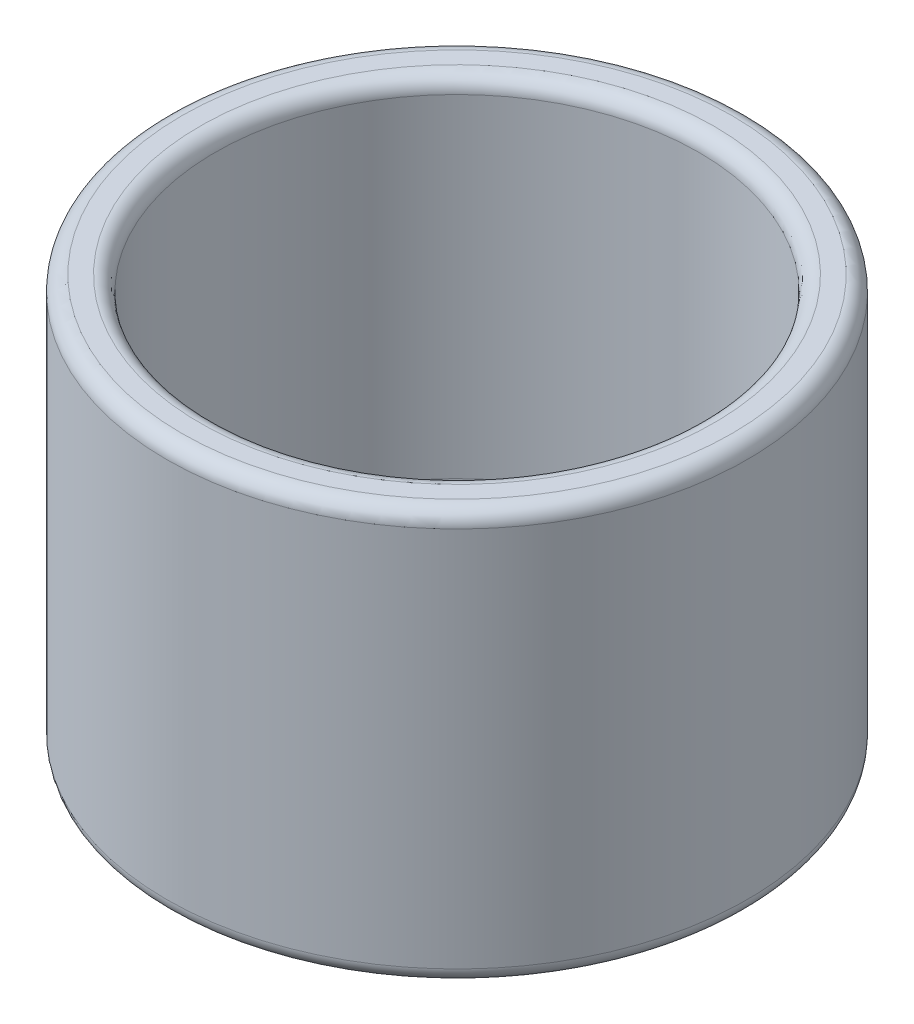
ISO-10303-21;
HEADER;
FILE_DESCRIPTION(('STEP AP214'),'2;1');
FILE_NAME('part.step','',(''),(''),'','','');
FILE_SCHEMA(('AUTOMOTIVE_DESIGN { 1 0 10303 214 1 1 1 1 }'));
ENDSEC;
DATA;
#1=APPLICATION_CONTEXT('core data for automotive mechanical design processes');
#2=APPLICATION_PROTOCOL_DEFINITION('international standard','automotive_design',2000,#1);
#3=PRODUCT_CONTEXT('',#1,'mechanical');
#4=PRODUCT('Part','Part','',(#3));
#5=PRODUCT_RELATED_PRODUCT_CATEGORY('part','',(#4));
#6=PRODUCT_DEFINITION_FORMATION('','',#4);
#7=PRODUCT_DEFINITION_CONTEXT('part definition',#1,'design');
#8=PRODUCT_DEFINITION('design','',#6,#7);
#9=PRODUCT_DEFINITION_SHAPE('','',#8);
#10=(LENGTH_UNIT() NAMED_UNIT(*) SI_UNIT(.MILLI.,.METRE.));
#11=(NAMED_UNIT(*) PLANE_ANGLE_UNIT() SI_UNIT($,.RADIAN.));
#12=(NAMED_UNIT(*) SI_UNIT($,.STERADIAN.) SOLID_ANGLE_UNIT());
#13=UNCERTAINTY_MEASURE_WITH_UNIT(LENGTH_MEASURE(1.E-05),#10,'distance_accuracy_value','');
#14=(GEOMETRIC_REPRESENTATION_CONTEXT(3) GLOBAL_UNCERTAINTY_ASSIGNED_CONTEXT((#13)) GLOBAL_UNIT_ASSIGNED_CONTEXT((#10,
#11,#12)) REPRESENTATION_CONTEXT('',''));
#15=CARTESIAN_POINT('',(0.,0.,0.));
#16=DIRECTION('',(0.,0.,1.));
#17=DIRECTION('',(1.,0.,0.));
#18=AXIS2_PLACEMENT_3D('',#15,#16,#17);
#19=CARTESIAN_POINT('',(-12.7,21.59,0.));
#20=DIRECTION('',(0.,-1.,0.));
#21=DIRECTION('',(0.,0.,-1.));
#22=AXIS2_PLACEMENT_3D('',#19,#20,#21);
#23=PLANE('',#22);
#24=CARTESIAN_POINT('',(0.,21.59,0.));
#25=DIRECTION('',(0.,-1.,0.));
#26=DIRECTION('',(0.,0.,-1.));
#27=AXIS2_PLACEMENT_3D('',#24,#25,#26);
#28=CIRCLE('',#27,13.49375);
#29=CARTESIAN_POINT('',(0.,21.59,-13.49375));
#30=VERTEX_POINT('',#29);
#31=EDGE_CURVE('E10',#30,#30,#28,.T.);
#32=ORIENTED_EDGE('',*,*,#31,.T.);
#33=EDGE_LOOP('',(#32));
#34=FACE_BOUND('',#33,.T.);
#35=CARTESIAN_POINT('',(0.,21.59,0.));
#36=DIRECTION('',(0.,-1.,0.));
#37=DIRECTION('',(0.,0.,-1.));
#38=AXIS2_PLACEMENT_3D('',#35,#36,#37);
#39=CIRCLE('',#38,14.44625);
#40=CARTESIAN_POINT('',(0.,21.59,-14.44625));
#41=VERTEX_POINT('',#40);
#42=EDGE_CURVE('E38',#41,#41,#39,.F.);
#43=ORIENTED_EDGE('',*,*,#42,.T.);
#44=EDGE_LOOP('',(#43));
#45=FACE_BOUND('',#44,.T.);
#46=ADVANCED_FACE('F31',(#34,#45),#23,.F.);
#47=CARTESIAN_POINT('',(0.,0.,0.));
#48=DIRECTION('',(0.,-1.,0.));
#49=DIRECTION('',(0.,0.,-1.));
#50=AXIS2_PLACEMENT_3D('',#47,#48,#49);
#51=CYLINDRICAL_SURFACE('',#50,15.24);
#52=CARTESIAN_POINT('',(0.,0.79375,0.));
#53=DIRECTION('',(0.,1.,0.));
#54=DIRECTION('',(0.,0.,1.));
#55=AXIS2_PLACEMENT_3D('',#52,#53,#54);
#56=CIRCLE('',#55,15.24);
#57=CARTESIAN_POINT('',(0.,0.79375,15.24));
#58=VERTEX_POINT('',#57);
#59=EDGE_CURVE('E54',#58,#58,#56,.T.);
#60=ORIENTED_EDGE('',*,*,#59,.T.);
#61=EDGE_LOOP('',(#60));
#62=FACE_BOUND('',#61,.T.);
#63=CARTESIAN_POINT('',(0.,20.79625,0.));
#64=DIRECTION('',(0.,-1.,0.));
#65=DIRECTION('',(0.,0.,-1.));
#66=AXIS2_PLACEMENT_3D('',#63,#64,#65);
#67=CIRCLE('',#66,15.24);
#68=CARTESIAN_POINT('',(0.,20.79625,-15.24));
#69=VERTEX_POINT('',#68);
#70=EDGE_CURVE('E57',#69,#69,#67,.T.);
#71=ORIENTED_EDGE('',*,*,#70,.T.);
#72=EDGE_LOOP('',(#71));
#73=FACE_BOUND('',#72,.T.);
#74=ADVANCED_FACE('F104',(#62,#73),#51,.T.);
#75=CARTESIAN_POINT('',(-15.24,0.,0.));
#76=DIRECTION('',(0.,1.,0.));
#77=DIRECTION('',(0.,0.,1.));
#78=AXIS2_PLACEMENT_3D('',#75,#76,#77);
#79=PLANE('',#78);
#80=CARTESIAN_POINT('',(0.,0.,0.));
#81=DIRECTION('',(0.,1.,0.));
#82=DIRECTION('',(0.,0.,1.));
#83=AXIS2_PLACEMENT_3D('',#80,#81,#82);
#84=CIRCLE('',#83,2.5527);
#85=CARTESIAN_POINT('',(0.,0.,2.5527));
#86=VERTEX_POINT('',#85);
#87=EDGE_CURVE('E63',#86,#86,#84,.T.);
#88=ORIENTED_EDGE('',*,*,#87,.T.);
#89=EDGE_LOOP('',(#88));
#90=FACE_BOUND('',#89,.T.);
#91=CARTESIAN_POINT('',(0.,0.,0.));
#92=DIRECTION('',(0.,1.,0.));
#93=DIRECTION('',(0.,0.,1.));
#94=AXIS2_PLACEMENT_3D('',#91,#92,#93);
#95=CIRCLE('',#94,14.44625);
#96=CARTESIAN_POINT('',(0.,0.,14.44625));
#97=VERTEX_POINT('',#96);
#98=EDGE_CURVE('E60',#97,#97,#95,.F.);
#99=ORIENTED_EDGE('',*,*,#98,.T.);
#100=EDGE_LOOP('',(#99));
#101=FACE_BOUND('',#100,.T.);
#102=ADVANCED_FACE('F79',(#90,#101),#79,.F.);
#103=CARTESIAN_POINT('',(0.,2.54,0.));
#104=DIRECTION('',(0.,-1.,0.));
#105=DIRECTION('',(0.,0.,-1.));
#106=AXIS2_PLACEMENT_3D('',#103,#104,#105);
#107=PLANE('',#106);
#108=CARTESIAN_POINT('',(0.,2.54,0.));
#109=DIRECTION('',(0.,1.,0.));
#110=DIRECTION('',(0.,0.,1.));
#111=AXIS2_PLACEMENT_3D('',#108,#109,#110);
#112=CIRCLE('',#111,4.8895);
#113=CARTESIAN_POINT('',(0.,2.54,4.8895));
#114=VERTEX_POINT('',#113);
#115=EDGE_CURVE('E69',#114,#114,#112,.T.);
#116=ORIENTED_EDGE('',*,*,#115,.F.);
#117=EDGE_LOOP('',(#116));
#118=FACE_BOUND('',#117,.T.);
#119=CARTESIAN_POINT('',(0.,2.54,0.));
#120=DIRECTION('',(0.,-1.,0.));
#121=DIRECTION('',(0.,0.,-1.));
#122=AXIS2_PLACEMENT_3D('',#119,#120,#121);
#123=CIRCLE('',#122,11.90625);
#124=CARTESIAN_POINT('',(0.,2.54,-11.90625));
#125=VERTEX_POINT('',#124);
#126=EDGE_CURVE('E42',#125,#125,#123,.F.);
#127=ORIENTED_EDGE('',*,*,#126,.T.);
#128=EDGE_LOOP('',(#127));
#129=FACE_BOUND('',#128,.T.);
#130=ADVANCED_FACE('F75',(#118,#129),#107,.F.);
#131=CARTESIAN_POINT('',(0.,0.,0.));
#132=DIRECTION('',(0.,-1.,0.));
#133=DIRECTION('',(0.,0.,-1.));
#134=AXIS2_PLACEMENT_3D('',#131,#132,#133);
#135=CYLINDRICAL_SURFACE('',#134,12.7);
#136=CARTESIAN_POINT('',(0.,3.33375,0.));
#137=DIRECTION('',(0.,-1.,0.));
#138=DIRECTION('',(0.,0.,-1.));
#139=AXIS2_PLACEMENT_3D('',#136,#137,#138);
#140=CIRCLE('',#139,12.7);
#141=CARTESIAN_POINT('',(0.,3.33375,-12.7));
#142=VERTEX_POINT('',#141);
#143=EDGE_CURVE('E46',#142,#142,#140,.T.);
#144=ORIENTED_EDGE('',*,*,#143,.T.);
#145=EDGE_LOOP('',(#144));
#146=FACE_BOUND('',#145,.T.);
#147=CARTESIAN_POINT('',(0.,20.79625,0.));
#148=DIRECTION('',(0.,-1.,0.));
#149=DIRECTION('',(0.,0.,-1.));
#150=AXIS2_PLACEMENT_3D('',#147,#148,#149);
#151=CIRCLE('',#150,12.7);
#152=CARTESIAN_POINT('',(0.,20.79625,-12.7));
#153=VERTEX_POINT('',#152);
#154=EDGE_CURVE('E51',#153,#153,#151,.F.);
#155=ORIENTED_EDGE('',*,*,#154,.T.);
#156=EDGE_LOOP('',(#155));
#157=FACE_BOUND('',#156,.T.);
#158=ADVANCED_FACE('F78',(#146,#157),#135,.F.);
#159=CARTESIAN_POINT('',(0.,0.79375,0.));
#160=DIRECTION('',(0.,1.,0.));
#161=DIRECTION('',(0.,0.,1.));
#162=AXIS2_PLACEMENT_3D('',#159,#160,#161);
#163=TOROIDAL_SURFACE('',#162,14.44625,0.79375);
#164=ORIENTED_EDGE('',*,*,#59,.F.);
#165=EDGE_LOOP('',(#164));
#166=FACE_BOUND('',#165,.T.);
#167=ORIENTED_EDGE('',*,*,#98,.F.);
#168=EDGE_LOOP('',(#167));
#169=FACE_BOUND('',#168,.T.);
#170=ADVANCED_FACE('F87',(#166,#169),#163,.T.);
#171=CARTESIAN_POINT('',(0.,3.33375,0.));
#172=DIRECTION('',(0.,-1.,0.));
#173=DIRECTION('',(0.,0.,-1.));
#174=AXIS2_PLACEMENT_3D('',#171,#172,#173);
#175=TOROIDAL_SURFACE('',#174,11.90625,0.79375);
#176=ORIENTED_EDGE('',*,*,#126,.F.);
#177=EDGE_LOOP('',(#176));
#178=FACE_BOUND('',#177,.T.);
#179=ORIENTED_EDGE('',*,*,#143,.F.);
#180=EDGE_LOOP('',(#179));
#181=FACE_BOUND('',#180,.T.);
#182=ADVANCED_FACE('F83',(#178,#181),#175,.F.);
#183=CARTESIAN_POINT('',(0.,20.79625,0.));
#184=DIRECTION('',(0.,-1.,0.));
#185=DIRECTION('',(0.,0.,-1.));
#186=AXIS2_PLACEMENT_3D('',#183,#184,#185);
#187=TOROIDAL_SURFACE('',#186,13.49375,0.79375);
#188=ORIENTED_EDGE('',*,*,#154,.F.);
#189=EDGE_LOOP('',(#188));
#190=FACE_BOUND('',#189,.T.);
#191=ORIENTED_EDGE('',*,*,#31,.F.);
#192=EDGE_LOOP('',(#191));
#193=FACE_BOUND('',#192,.T.);
#194=ADVANCED_FACE('F86',(#190,#193),#187,.T.);
#195=CARTESIAN_POINT('',(0.,20.79625,0.));
#196=DIRECTION('',(0.,-1.,0.));
#197=DIRECTION('',(0.,0.,-1.));
#198=AXIS2_PLACEMENT_3D('',#195,#196,#197);
#199=TOROIDAL_SURFACE('',#198,14.44625,0.79375);
#200=ORIENTED_EDGE('',*,*,#42,.F.);
#201=EDGE_LOOP('',(#200));
#202=FACE_BOUND('',#201,.T.);
#203=ORIENTED_EDGE('',*,*,#70,.F.);
#204=EDGE_LOOP('',(#203));
#205=FACE_BOUND('',#204,.T.);
#206=ADVANCED_FACE('F33',(#202,#205),#199,.T.);
#207=CARTESIAN_POINT('',(0.,2.54,0.));
#208=DIRECTION('',(0.,1.,0.));
#209=DIRECTION('',(0.,0.,1.));
#210=AXIS2_PLACEMENT_3D('',#207,#208,#209);
#211=CYLINDRICAL_SURFACE('',#210,2.55269999999999);
#212=ORIENTED_EDGE('',*,*,#87,.F.);
#213=EDGE_LOOP('',(#212));
#214=FACE_BOUND('',#213,.T.);
#215=CARTESIAN_POINT('',(0.,0.579191981864928,0.));
#216=DIRECTION('',(0.,1.,0.));
#217=DIRECTION('',(0.,0.,1.));
#218=AXIS2_PLACEMENT_3D('',#215,#216,#217);
#219=CIRCLE('',#218,2.55269999999999);
#220=CARTESIAN_POINT('',(0.,0.579191981864928,2.55269999999999));
#221=VERTEX_POINT('',#220);
#222=EDGE_CURVE('E66',#221,#221,#219,.T.);
#223=ORIENTED_EDGE('',*,*,#222,.T.);
#224=EDGE_LOOP('',(#223));
#225=FACE_BOUND('',#224,.T.);
#226=ADVANCED_FACE('F101',(#214,#225),#211,.F.);
#227=CARTESIAN_POINT('',(0.,2.54,0.));
#228=DIRECTION('',(0.,1.,0.));
#229=DIRECTION('',(0.,0.,1.));
#230=AXIS2_PLACEMENT_3D('',#227,#228,#229);
#231=CONICAL_SURFACE('',#230,4.8895,0.872664625997166);
#232=ORIENTED_EDGE('',*,*,#222,.F.);
#233=EDGE_LOOP('',(#232));
#234=FACE_BOUND('',#233,.T.);
#235=ORIENTED_EDGE('',*,*,#115,.T.);
#236=EDGE_LOOP('',(#235));
#237=FACE_BOUND('',#236,.T.);
#238=ADVANCED_FACE('F73',(#234,#237),#231,.F.);
#239=CLOSED_SHELL('',(#46,#74,#102,#130,#158,#170,#182,#194,#206,#226,#238));
#240=MANIFOLD_SOLID_BREP('B2',#239);
#241=ADVANCED_BREP_SHAPE_REPRESENTATION('',(#18,#240),#14);
#242=SHAPE_DEFINITION_REPRESENTATION(#9,#241);
ENDSEC;
END-ISO-10303-21;
